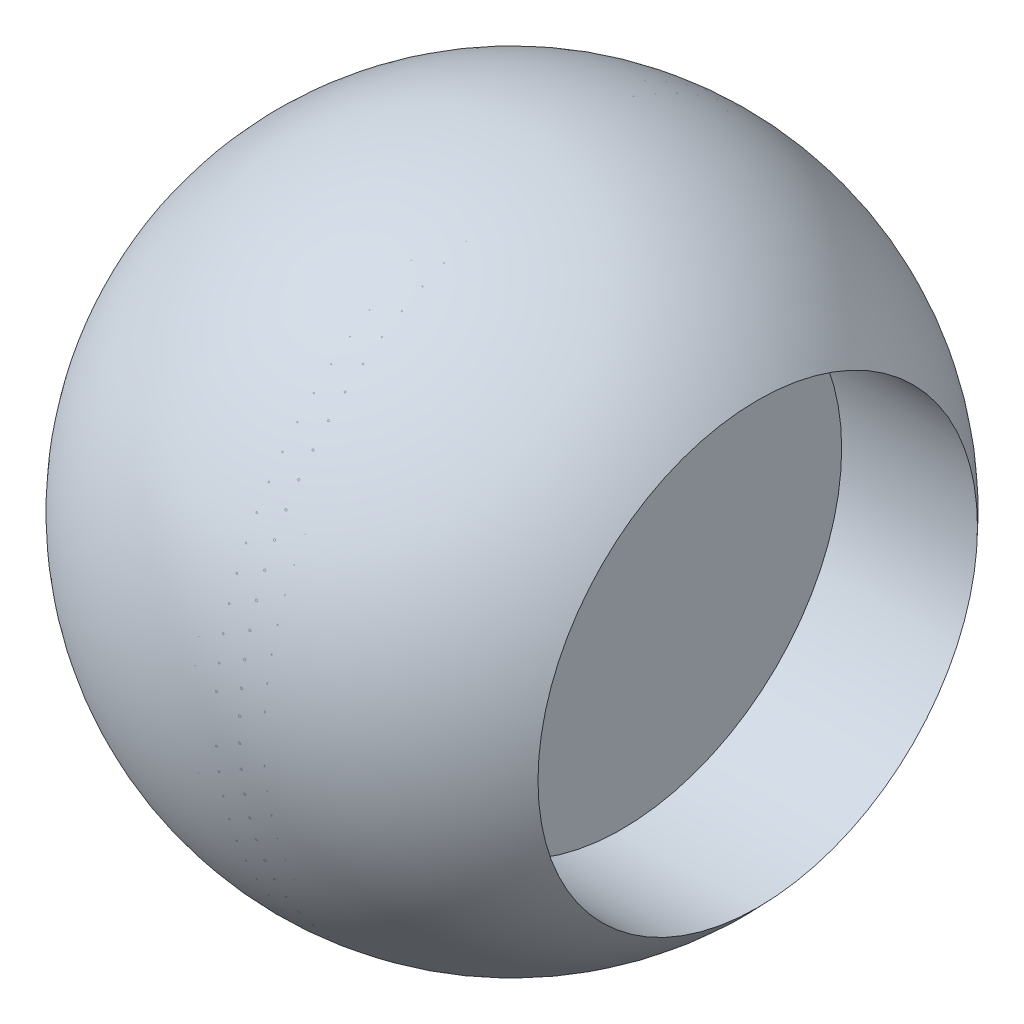
ISO-10303-21;
HEADER;
FILE_DESCRIPTION(('STEP AP214'),'2;1');
FILE_NAME('part.step','',(''),(''),'','','');
FILE_SCHEMA(('AUTOMOTIVE_DESIGN { 1 0 10303 214 1 1 1 1 }'));
ENDSEC;
DATA;
#1=APPLICATION_CONTEXT('core data for automotive mechanical design processes');
#2=APPLICATION_PROTOCOL_DEFINITION('international standard','automotive_design',2000,#1);
#3=PRODUCT_CONTEXT('',#1,'mechanical');
#4=PRODUCT('Part','Part','',(#3));
#5=PRODUCT_RELATED_PRODUCT_CATEGORY('part','',(#4));
#6=PRODUCT_DEFINITION_FORMATION('','',#4);
#7=PRODUCT_DEFINITION_CONTEXT('part definition',#1,'design');
#8=PRODUCT_DEFINITION('design','',#6,#7);
#9=PRODUCT_DEFINITION_SHAPE('','',#8);
#10=(LENGTH_UNIT() NAMED_UNIT(*) SI_UNIT(.MILLI.,.METRE.));
#11=(NAMED_UNIT(*) PLANE_ANGLE_UNIT() SI_UNIT($,.RADIAN.));
#12=(NAMED_UNIT(*) SI_UNIT($,.STERADIAN.) SOLID_ANGLE_UNIT());
#13=UNCERTAINTY_MEASURE_WITH_UNIT(LENGTH_MEASURE(1.E-05),#10,'distance_accuracy_value','');
#14=(GEOMETRIC_REPRESENTATION_CONTEXT(3) GLOBAL_UNCERTAINTY_ASSIGNED_CONTEXT((#13)) GLOBAL_UNIT_ASSIGNED_CONTEXT((#10,
#11,#12)) REPRESENTATION_CONTEXT('',''));
#15=CARTESIAN_POINT('',(0.,0.,0.));
#16=DIRECTION('',(0.,0.,1.));
#17=DIRECTION('',(1.,0.,0.));
#18=AXIS2_PLACEMENT_3D('',#15,#16,#17);
#19=CARTESIAN_POINT('',(0.,0.,0.));
#20=DIRECTION('',(0.,-1.,0.));
#21=DIRECTION('',(-1.,0.,0.));
#22=AXIS2_PLACEMENT_3D('',#19,#20,#21);
#23=SPHERICAL_SURFACE('',#22,22.5);
#24=CARTESIAN_POINT('',(0.,0.,0.));
#25=DIRECTION('',(-1.,0.,0.));
#26=DIRECTION('',(0.,0.,1.));
#27=AXIS2_PLACEMENT_3D('',#24,#25,#26);
#28=SPHERICAL_SURFACE('',#27,22.5);
#29=CARTESIAN_POINT('',(16.7705098312484,0.,0.));
#30=DIRECTION('',(-1.,0.,0.));
#31=DIRECTION('',(0.,0.,1.));
#32=AXIS2_PLACEMENT_3D('',#29,#30,#31);
#33=CIRCLE('',#32,15.);
#34=CARTESIAN_POINT('',(16.7705098312484,0.,15.));
#35=VERTEX_POINT('',#34);
#36=EDGE_CURVE('E38',#35,#35,#33,.T.);
#37=ORIENTED_EDGE('',*,*,#36,.T.);
#38=EDGE_LOOP('',(#37));
#39=FACE_BOUND('',#38,.T.);
#40=ADVANCED_FACE('F35',(#39),#28,.T.);
#41=CARTESIAN_POINT('',(7.5,0.,0.));
#42=DIRECTION('',(1.,0.,0.));
#43=DIRECTION('',(0.,0.,-1.));
#44=AXIS2_PLACEMENT_3D('',#41,#42,#43);
#45=CYLINDRICAL_SURFACE('',#44,15.);
#46=CARTESIAN_POINT('',(7.5,0.,0.));
#47=DIRECTION('',(1.,0.,0.));
#48=DIRECTION('',(0.,0.,-1.));
#49=AXIS2_PLACEMENT_3D('',#46,#47,#48);
#50=CIRCLE('',#49,15.);
#51=CARTESIAN_POINT('',(7.5,0.,-15.));
#52=VERTEX_POINT('',#51);
#53=EDGE_CURVE('E54',#52,#52,#50,.T.);
#54=ORIENTED_EDGE('',*,*,#53,.F.);
#55=EDGE_LOOP('',(#54));
#56=FACE_BOUND('',#55,.T.);
#57=ORIENTED_EDGE('',*,*,#36,.F.);
#58=EDGE_LOOP('',(#57));
#59=FACE_BOUND('',#58,.T.);
#60=ADVANCED_FACE('F62',(#56,#59),#45,.F.);
#61=CARTESIAN_POINT('',(7.5,0.,0.));
#62=DIRECTION('',(1.,0.,0.));
#63=DIRECTION('',(0.,0.,-1.));
#64=AXIS2_PLACEMENT_3D('',#61,#62,#63);
#65=PLANE('',#64);
#66=ORIENTED_EDGE('',*,*,#53,.T.);
#67=EDGE_LOOP('',(#66));
#68=FACE_BOUND('',#67,.T.);
#69=ADVANCED_FACE('F64',(#68),#65,.T.);
#70=CLOSED_SHELL('',(#40,#60,#69));
#71=CARTESIAN_POINT('',(4.99999999999999,19.9178093849696,0.));
#72=DIRECTION('',(1.,0.,0.));
#73=DIRECTION('',(0.,0.,-1.));
#74=AXIS2_PLACEMENT_3D('',#71,#72,#73);
#75=PLANE('',#74);
#76=CARTESIAN_POINT('',(5.,0.,0.));
#77=DIRECTION('',(1.,0.,0.));
#78=DIRECTION('',(0.,0.,-1.));
#79=AXIS2_PLACEMENT_3D('',#76,#77,#78);
#80=CIRCLE('',#79,21.9178093849696);
#81=CARTESIAN_POINT('',(5.,0.,-21.9178093849696));
#82=VERTEX_POINT('',#81);
#83=EDGE_CURVE('E10',#82,#82,#80,.T.);
#84=ORIENTED_EDGE('',*,*,#83,.F.);
#85=EDGE_LOOP('',(#84));
#86=FACE_BOUND('',#85,.T.);
#87=CARTESIAN_POINT('',(4.99999999999999,0.,0.));
#88=DIRECTION('',(1.,0.,0.));
#89=DIRECTION('',(0.,0.,-1.));
#90=AXIS2_PLACEMENT_3D('',#87,#88,#89);
#91=CIRCLE('',#90,19.9178093849696);
#92=CARTESIAN_POINT('',(4.99999999999999,0.,-19.9178093849696));
#93=VERTEX_POINT('',#92);
#94=EDGE_CURVE('E51',#93,#93,#91,.T.);
#95=ORIENTED_EDGE('',*,*,#94,.T.);
#96=EDGE_LOOP('',(#95));
#97=FACE_BOUND('',#96,.T.);
#98=ADVANCED_FACE('F84',(#86,#97),#75,.F.);
#99=CARTESIAN_POINT('',(0.,0.,0.));
#100=DIRECTION('',(1.,0.,0.));
#101=DIRECTION('',(0.,1.,0.));
#102=AXIS2_PLACEMENT_3D('',#99,#100,#101);
#103=SPHERICAL_SURFACE('',#102,22.480888955641);
#104=CARTESIAN_POINT('',(-5.00000000000001,0.,0.));
#105=DIRECTION('',(1.,0.,0.));
#106=DIRECTION('',(0.,0.,-1.));
#107=AXIS2_PLACEMENT_3D('',#104,#105,#106);
#108=CIRCLE('',#107,21.9178093849696);
#109=CARTESIAN_POINT('',(-5.00000000000001,0.,-21.9178093849696));
#110=VERTEX_POINT('',#109);
#111=EDGE_CURVE('E42',#110,#110,#108,.T.);
#112=ORIENTED_EDGE('',*,*,#111,.F.);
#113=EDGE_LOOP('',(#112));
#114=FACE_BOUND('',#113,.T.);
#115=ORIENTED_EDGE('',*,*,#83,.T.);
#116=EDGE_LOOP('',(#115));
#117=FACE_BOUND('',#116,.T.);
#118=ADVANCED_FACE('F81',(#114,#117),#103,.F.);
#119=CARTESIAN_POINT('',(-5.00000000000001,19.9178093849696,0.));
#120=DIRECTION('',(-1.,0.,0.));
#121=DIRECTION('',(0.,0.,1.));
#122=AXIS2_PLACEMENT_3D('',#119,#120,#121);
#123=PLANE('',#122);
#124=CARTESIAN_POINT('',(-5.00000000000001,0.,0.));
#125=DIRECTION('',(1.,0.,0.));
#126=DIRECTION('',(0.,0.,-1.));
#127=AXIS2_PLACEMENT_3D('',#124,#125,#126);
#128=CIRCLE('',#127,19.9178093849696);
#129=CARTESIAN_POINT('',(-5.00000000000001,0.,-19.9178093849696));
#130=VERTEX_POINT('',#129);
#131=EDGE_CURVE('E46',#130,#130,#128,.T.);
#132=ORIENTED_EDGE('',*,*,#131,.F.);
#133=EDGE_LOOP('',(#132));
#134=FACE_BOUND('',#133,.T.);
#135=ORIENTED_EDGE('',*,*,#111,.T.);
#136=EDGE_LOOP('',(#135));
#137=FACE_BOUND('',#136,.T.);
#138=ADVANCED_FACE('F76',(#134,#137),#123,.F.);
#139=CARTESIAN_POINT('',(0.,0.,0.));
#140=DIRECTION('',(1.,0.,0.));
#141=DIRECTION('',(0.,0.,-1.));
#142=AXIS2_PLACEMENT_3D('',#139,#140,#141);
#143=CYLINDRICAL_SURFACE('',#142,19.9178093849696);
#144=ORIENTED_EDGE('',*,*,#94,.F.);
#145=EDGE_LOOP('',(#144));
#146=FACE_BOUND('',#145,.T.);
#147=ORIENTED_EDGE('',*,*,#131,.T.);
#148=EDGE_LOOP('',(#147));
#149=FACE_BOUND('',#148,.T.);
#150=ADVANCED_FACE('F73',(#146,#149),#143,.T.);
#151=CLOSED_SHELL('',(#98,#118,#138,#150));
#152=ORIENTED_CLOSED_SHELL('',*,#151,.T.);
#153=BREP_WITH_VOIDS('B2',#70,(#152));
#154=ADVANCED_BREP_SHAPE_REPRESENTATION('',(#18,#153),#14);
#155=SHAPE_DEFINITION_REPRESENTATION(#9,#154);
ENDSEC;
END-ISO-10303-21;
